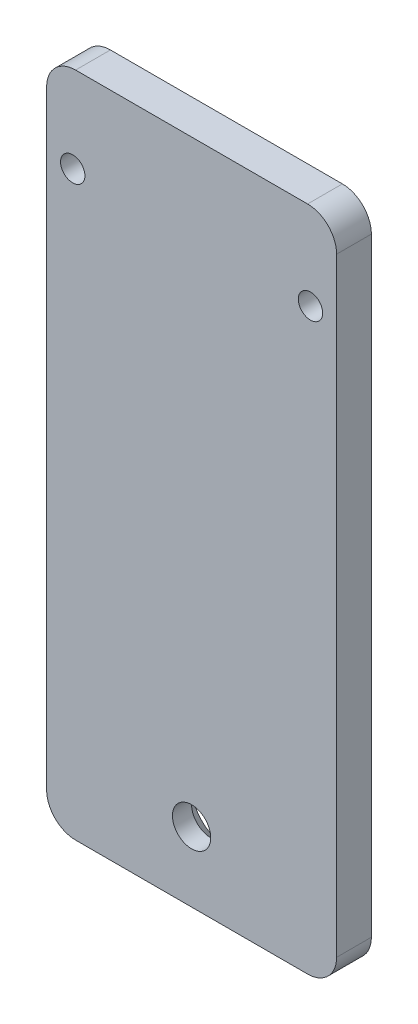
ISO-10303-21;
HEADER;
FILE_DESCRIPTION(('STEP AP214'),'2;1');
FILE_NAME('part.step','',(''),(''),'','','');
FILE_SCHEMA(('AUTOMOTIVE_DESIGN { 1 0 10303 214 1 1 1 1 }'));
ENDSEC;
DATA;
#1=APPLICATION_CONTEXT('core data for automotive mechanical design processes');
#2=APPLICATION_PROTOCOL_DEFINITION('international standard','automotive_design',2000,#1);
#3=PRODUCT_CONTEXT('',#1,'mechanical');
#4=PRODUCT('Part','Part','',(#3));
#5=PRODUCT_RELATED_PRODUCT_CATEGORY('part','',(#4));
#6=PRODUCT_DEFINITION_FORMATION('','',#4);
#7=PRODUCT_DEFINITION_CONTEXT('part definition',#1,'design');
#8=PRODUCT_DEFINITION('design','',#6,#7);
#9=PRODUCT_DEFINITION_SHAPE('','',#8);
#10=(LENGTH_UNIT() NAMED_UNIT(*) SI_UNIT(.MILLI.,.METRE.));
#11=(NAMED_UNIT(*) PLANE_ANGLE_UNIT() SI_UNIT($,.RADIAN.));
#12=(NAMED_UNIT(*) SI_UNIT($,.STERADIAN.) SOLID_ANGLE_UNIT());
#13=UNCERTAINTY_MEASURE_WITH_UNIT(LENGTH_MEASURE(1.E-05),#10,'distance_accuracy_value','');
#14=(GEOMETRIC_REPRESENTATION_CONTEXT(3) GLOBAL_UNCERTAINTY_ASSIGNED_CONTEXT((#13)) GLOBAL_UNIT_ASSIGNED_CONTEXT((#10,
#11,#12)) REPRESENTATION_CONTEXT('',''));
#15=CARTESIAN_POINT('',(0.,0.,0.));
#16=DIRECTION('',(0.,0.,1.));
#17=DIRECTION('',(1.,0.,0.));
#18=AXIS2_PLACEMENT_3D('',#15,#16,#17);
#19=CARTESIAN_POINT('',(0.,-45.5,-3.));
#20=DIRECTION('',(0.,0.,-1.));
#21=DIRECTION('',(0.,-1.,0.));
#22=AXIS2_PLACEMENT_3D('',#19,#20,#21);
#23=CONICAL_SURFACE('',#22,6.,0.785398163397448);
#24=CARTESIAN_POINT('',(0.,-45.5,-0.3));
#25=DIRECTION('',(0.,0.,-1.));
#26=DIRECTION('',(0.,-1.,0.));
#27=AXIS2_PLACEMENT_3D('',#24,#25,#26);
#28=CIRCLE('',#27,3.3);
#29=CARTESIAN_POINT('',(0.,-48.8,-0.3));
#30=VERTEX_POINT('',#29);
#31=EDGE_CURVE('E11',#30,#30,#28,.T.);
#32=ORIENTED_EDGE('',*,*,#31,.F.);
#33=EDGE_LOOP('',(#32));
#34=FACE_BOUND('',#33,.T.);
#35=CARTESIAN_POINT('',(0.,-45.5,-3.));
#36=DIRECTION('',(0.,0.,1.));
#37=DIRECTION('',(0.,-1.,0.));
#38=AXIS2_PLACEMENT_3D('',#35,#36,#37);
#39=CIRCLE('',#38,6.);
#40=CARTESIAN_POINT('',(0.,-51.5,-3.));
#41=VERTEX_POINT('',#40);
#42=EDGE_CURVE('E191',#41,#41,#39,.T.);
#43=ORIENTED_EDGE('',*,*,#42,.F.);
#44=EDGE_LOOP('',(#43));
#45=FACE_BOUND('',#44,.T.);
#46=ADVANCED_FACE('F17',(#34,#45),#23,.F.);
#47=CARTESIAN_POINT('',(0.,-45.5,125.242821379799));
#48=DIRECTION('',(0.,0.,-1.));
#49=DIRECTION('',(-1.,0.,0.));
#50=AXIS2_PLACEMENT_3D('',#47,#48,#49);
#51=CYLINDRICAL_SURFACE('',#50,3.3);
#52=CARTESIAN_POINT('',(0.,-45.5,3.));
#53=DIRECTION('',(0.,0.,1.));
#54=DIRECTION('',(1.,0.,0.));
#55=AXIS2_PLACEMENT_3D('',#52,#53,#54);
#56=CIRCLE('',#55,3.3);
#57=CARTESIAN_POINT('',(3.3,-45.5,3.));
#58=VERTEX_POINT('',#57);
#59=EDGE_CURVE('E108',#58,#58,#56,.T.);
#60=ORIENTED_EDGE('',*,*,#59,.T.);
#61=EDGE_LOOP('',(#60));
#62=FACE_BOUND('',#61,.T.);
#63=ORIENTED_EDGE('',*,*,#31,.T.);
#64=EDGE_LOOP('',(#63));
#65=FACE_BOUND('',#64,.T.);
#66=ADVANCED_FACE('F19',(#62,#65),#51,.F.);
#67=CARTESIAN_POINT('',(20.5,42.5,-122.542821379799));
#68=DIRECTION('',(0.,0.,1.));
#69=DIRECTION('',(1.,0.,0.));
#70=AXIS2_PLACEMENT_3D('',#67,#68,#69);
#71=CYLINDRICAL_SURFACE('',#70,2.1);
#72=CARTESIAN_POINT('',(20.5,42.5,3.));
#73=DIRECTION('',(0.,0.,1.));
#74=DIRECTION('',(1.,0.,0.));
#75=AXIS2_PLACEMENT_3D('',#72,#73,#74);
#76=CIRCLE('',#75,2.1);
#77=CARTESIAN_POINT('',(22.6,42.5,3.));
#78=VERTEX_POINT('',#77);
#79=EDGE_CURVE('E231',#78,#78,#76,.T.);
#80=ORIENTED_EDGE('',*,*,#79,.T.);
#81=EDGE_LOOP('',(#80));
#82=FACE_BOUND('',#81,.T.);
#83=CARTESIAN_POINT('',(20.5,42.5,-3.));
#84=DIRECTION('',(0.,0.,1.));
#85=DIRECTION('',(1.,0.,0.));
#86=AXIS2_PLACEMENT_3D('',#83,#84,#85);
#87=CIRCLE('',#86,2.1);
#88=CARTESIAN_POINT('',(22.6,42.5,-3.));
#89=VERTEX_POINT('',#88);
#90=EDGE_CURVE('E194',#89,#89,#87,.T.);
#91=ORIENTED_EDGE('',*,*,#90,.F.);
#92=EDGE_LOOP('',(#91));
#93=FACE_BOUND('',#92,.T.);
#94=ADVANCED_FACE('F289',(#82,#93),#71,.F.);
#95=CARTESIAN_POINT('',(-20.5,42.5,-122.542821379799));
#96=DIRECTION('',(0.,0.,1.));
#97=DIRECTION('',(1.,0.,0.));
#98=AXIS2_PLACEMENT_3D('',#95,#96,#97);
#99=CYLINDRICAL_SURFACE('',#98,2.1);
#100=CARTESIAN_POINT('',(-20.5,42.5,3.));
#101=DIRECTION('',(0.,0.,1.));
#102=DIRECTION('',(1.,0.,0.));
#103=AXIS2_PLACEMENT_3D('',#100,#101,#102);
#104=CIRCLE('',#103,2.1);
#105=CARTESIAN_POINT('',(-18.4,42.5,3.));
#106=VERTEX_POINT('',#105);
#107=EDGE_CURVE('E21',#106,#106,#104,.T.);
#108=ORIENTED_EDGE('',*,*,#107,.T.);
#109=EDGE_LOOP('',(#108));
#110=FACE_BOUND('',#109,.T.);
#111=CARTESIAN_POINT('',(-20.5,42.5,-3.));
#112=DIRECTION('',(0.,0.,1.));
#113=DIRECTION('',(1.,0.,0.));
#114=AXIS2_PLACEMENT_3D('',#111,#112,#113);
#115=CIRCLE('',#114,2.1);
#116=CARTESIAN_POINT('',(-18.4,42.5,-3.));
#117=VERTEX_POINT('',#116);
#118=EDGE_CURVE('E148',#117,#117,#115,.T.);
#119=ORIENTED_EDGE('',*,*,#118,.F.);
#120=EDGE_LOOP('',(#119));
#121=FACE_BOUND('',#120,.T.);
#122=ADVANCED_FACE('F279',(#110,#121),#99,.F.);
#123=CARTESIAN_POINT('',(-20.,52.5,3.));
#124=DIRECTION('',(0.,0.,-1.));
#125=DIRECTION('',(-1.,0.,0.));
#126=AXIS2_PLACEMENT_3D('',#123,#124,#125);
#127=CYLINDRICAL_SURFACE('',#126,5.);
#128=CARTESIAN_POINT('',(-20.,52.5,3.));
#129=DIRECTION('',(0.,0.,1.));
#130=DIRECTION('',(1.,0.,0.));
#131=AXIS2_PLACEMENT_3D('',#128,#129,#130);
#132=CIRCLE('',#131,5.);
#133=CARTESIAN_POINT('',(-20.,57.5,3.));
#134=VERTEX_POINT('',#133);
#135=CARTESIAN_POINT('',(-25.,52.5,3.));
#136=VERTEX_POINT('',#135);
#137=EDGE_CURVE('E188',#134,#136,#132,.T.);
#138=ORIENTED_EDGE('',*,*,#137,.F.);
#139=DIRECTION('',(0.,0.,1.));
#140=VECTOR('',#139,1.);
#141=CARTESIAN_POINT('',(-20.,57.5,3.));
#142=LINE('',#141,#140);
#143=CARTESIAN_POINT('',(-20.,57.5,-3.));
#144=VERTEX_POINT('',#143);
#145=EDGE_CURVE('E142',#144,#134,#142,.T.);
#146=ORIENTED_EDGE('',*,*,#145,.F.);
#147=CARTESIAN_POINT('',(-20.,52.5,-3.));
#148=DIRECTION('',(0.,0.,-1.));
#149=DIRECTION('',(1.,0.,0.));
#150=AXIS2_PLACEMENT_3D('',#147,#148,#149);
#151=CIRCLE('',#150,5.);
#152=CARTESIAN_POINT('',(-25.,52.5,-3.));
#153=VERTEX_POINT('',#152);
#154=EDGE_CURVE('E135',#153,#144,#151,.T.);
#155=ORIENTED_EDGE('',*,*,#154,.F.);
#156=DIRECTION('',(0.,0.,-1.));
#157=VECTOR('',#156,1.);
#158=CARTESIAN_POINT('',(-25.,52.5,3.));
#159=LINE('',#158,#157);
#160=EDGE_CURVE('E139',#136,#153,#159,.T.);
#161=ORIENTED_EDGE('',*,*,#160,.F.);
#162=EDGE_LOOP('',(#138,#146,#155,#161));
#163=FACE_BOUND('',#162,.T.);
#164=ADVANCED_FACE('F137',(#163),#127,.T.);
#165=CARTESIAN_POINT('',(20.,-52.5,3.));
#166=DIRECTION('',(0.,0.,-1.));
#167=DIRECTION('',(-1.,0.,0.));
#168=AXIS2_PLACEMENT_3D('',#165,#166,#167);
#169=CYLINDRICAL_SURFACE('',#168,5.);
#170=CARTESIAN_POINT('',(20.,-52.5,3.));
#171=DIRECTION('',(0.,0.,1.));
#172=DIRECTION('',(1.,0.,0.));
#173=AXIS2_PLACEMENT_3D('',#170,#171,#172);
#174=CIRCLE('',#173,5.);
#175=CARTESIAN_POINT('',(20.,-57.5,3.));
#176=VERTEX_POINT('',#175);
#177=CARTESIAN_POINT('',(25.,-52.5,3.));
#178=VERTEX_POINT('',#177);
#179=EDGE_CURVE('E172',#176,#178,#174,.T.);
#180=ORIENTED_EDGE('',*,*,#179,.F.);
#181=DIRECTION('',(0.,0.,1.));
#182=VECTOR('',#181,1.);
#183=CARTESIAN_POINT('',(20.,-57.5,3.));
#184=LINE('',#183,#182);
#185=CARTESIAN_POINT('',(20.,-57.5,-3.));
#186=VERTEX_POINT('',#185);
#187=EDGE_CURVE('E208',#186,#176,#184,.T.);
#188=ORIENTED_EDGE('',*,*,#187,.F.);
#189=CARTESIAN_POINT('',(20.,-52.5,-3.));
#190=DIRECTION('',(0.,0.,-1.));
#191=DIRECTION('',(1.,0.,0.));
#192=AXIS2_PLACEMENT_3D('',#189,#190,#191);
#193=CIRCLE('',#192,5.);
#194=CARTESIAN_POINT('',(25.,-52.5,-3.));
#195=VERTEX_POINT('',#194);
#196=EDGE_CURVE('E195',#195,#186,#193,.T.);
#197=ORIENTED_EDGE('',*,*,#196,.F.);
#198=DIRECTION('',(0.,0.,-1.));
#199=VECTOR('',#198,1.);
#200=CARTESIAN_POINT('',(25.,-52.5,3.));
#201=LINE('',#200,#199);
#202=EDGE_CURVE('E178',#178,#195,#201,.T.);
#203=ORIENTED_EDGE('',*,*,#202,.F.);
#204=EDGE_LOOP('',(#180,#188,#197,#203));
#205=FACE_BOUND('',#204,.T.);
#206=ADVANCED_FACE('F270',(#205),#169,.T.);
#207=CARTESIAN_POINT('',(-20.,-52.5,3.));
#208=DIRECTION('',(0.,0.,-1.));
#209=DIRECTION('',(-1.,0.,0.));
#210=AXIS2_PLACEMENT_3D('',#207,#208,#209);
#211=CYLINDRICAL_SURFACE('',#210,5.);
#212=CARTESIAN_POINT('',(-20.,-52.5,3.));
#213=DIRECTION('',(0.,0.,1.));
#214=DIRECTION('',(1.,0.,0.));
#215=AXIS2_PLACEMENT_3D('',#212,#213,#214);
#216=CIRCLE('',#215,5.);
#217=CARTESIAN_POINT('',(-25.,-52.5,3.));
#218=VERTEX_POINT('',#217);
#219=CARTESIAN_POINT('',(-20.,-57.5,3.));
#220=VERTEX_POINT('',#219);
#221=EDGE_CURVE('E173',#218,#220,#216,.T.);
#222=ORIENTED_EDGE('',*,*,#221,.F.);
#223=DIRECTION('',(0.,0.,1.));
#224=VECTOR('',#223,1.);
#225=CARTESIAN_POINT('',(-25.,-52.5,3.));
#226=LINE('',#225,#224);
#227=CARTESIAN_POINT('',(-25.,-52.5,-3.));
#228=VERTEX_POINT('',#227);
#229=EDGE_CURVE('E159',#228,#218,#226,.T.);
#230=ORIENTED_EDGE('',*,*,#229,.F.);
#231=CARTESIAN_POINT('',(-20.,-52.5,-3.));
#232=DIRECTION('',(0.,0.,-1.));
#233=DIRECTION('',(1.,0.,0.));
#234=AXIS2_PLACEMENT_3D('',#231,#232,#233);
#235=CIRCLE('',#234,5.);
#236=CARTESIAN_POINT('',(-20.,-57.5,-3.));
#237=VERTEX_POINT('',#236);
#238=EDGE_CURVE('E28',#237,#228,#235,.T.);
#239=ORIENTED_EDGE('',*,*,#238,.F.);
#240=DIRECTION('',(0.,0.,-1.));
#241=VECTOR('',#240,1.);
#242=CARTESIAN_POINT('',(-20.,-57.5,3.));
#243=LINE('',#242,#241);
#244=EDGE_CURVE('E179',#220,#237,#243,.T.);
#245=ORIENTED_EDGE('',*,*,#244,.F.);
#246=EDGE_LOOP('',(#222,#230,#239,#245));
#247=FACE_BOUND('',#246,.T.);
#248=ADVANCED_FACE('F242',(#247),#211,.T.);
#249=CARTESIAN_POINT('',(20.,52.5,3.));
#250=DIRECTION('',(0.,0.,-1.));
#251=DIRECTION('',(-1.,0.,0.));
#252=AXIS2_PLACEMENT_3D('',#249,#250,#251);
#253=CYLINDRICAL_SURFACE('',#252,5.);
#254=CARTESIAN_POINT('',(20.,52.5,3.));
#255=DIRECTION('',(0.,0.,1.));
#256=DIRECTION('',(1.,0.,0.));
#257=AXIS2_PLACEMENT_3D('',#254,#255,#256);
#258=CIRCLE('',#257,5.);
#259=CARTESIAN_POINT('',(25.,52.5,3.));
#260=VERTEX_POINT('',#259);
#261=CARTESIAN_POINT('',(20.,57.5,3.));
#262=VERTEX_POINT('',#261);
#263=EDGE_CURVE('E117',#260,#262,#258,.T.);
#264=ORIENTED_EDGE('',*,*,#263,.F.);
#265=DIRECTION('',(0.,0.,1.));
#266=VECTOR('',#265,1.);
#267=CARTESIAN_POINT('',(25.,52.5,3.));
#268=LINE('',#267,#266);
#269=CARTESIAN_POINT('',(25.,52.5,-3.));
#270=VERTEX_POINT('',#269);
#271=EDGE_CURVE('E227',#270,#260,#268,.T.);
#272=ORIENTED_EDGE('',*,*,#271,.F.);
#273=CARTESIAN_POINT('',(20.,52.5,-3.));
#274=DIRECTION('',(0.,0.,-1.));
#275=DIRECTION('',(1.,0.,0.));
#276=AXIS2_PLACEMENT_3D('',#273,#274,#275);
#277=CIRCLE('',#276,5.);
#278=CARTESIAN_POINT('',(20.,57.5,-3.));
#279=VERTEX_POINT('',#278);
#280=EDGE_CURVE('E147',#279,#270,#277,.T.);
#281=ORIENTED_EDGE('',*,*,#280,.F.);
#282=DIRECTION('',(0.,0.,-1.));
#283=VECTOR('',#282,1.);
#284=CARTESIAN_POINT('',(20.,57.5,3.));
#285=LINE('',#284,#283);
#286=EDGE_CURVE('E180',#262,#279,#285,.T.);
#287=ORIENTED_EDGE('',*,*,#286,.F.);
#288=EDGE_LOOP('',(#264,#272,#281,#287));
#289=FACE_BOUND('',#288,.T.);
#290=ADVANCED_FACE('F265',(#289),#253,.T.);
#291=CARTESIAN_POINT('',(0.,0.,-3.));
#292=DIRECTION('',(0.,0.,1.));
#293=DIRECTION('',(1.,0.,0.));
#294=AXIS2_PLACEMENT_3D('',#291,#292,#293);
#295=PLANE('',#294);
#296=DIRECTION('',(0.,-1.,0.));
#297=VECTOR('',#296,1.);
#298=CARTESIAN_POINT('',(-25.,57.5,-3.));
#299=LINE('',#298,#297);
#300=EDGE_CURVE('E151',#153,#228,#299,.T.);
#301=ORIENTED_EDGE('',*,*,#300,.F.);
#302=ORIENTED_EDGE('',*,*,#154,.T.);
#303=DIRECTION('',(-1.,0.,0.));
#304=VECTOR('',#303,1.);
#305=CARTESIAN_POINT('',(25.,57.5,-3.));
#306=LINE('',#305,#304);
#307=EDGE_CURVE('E187',#279,#144,#306,.T.);
#308=ORIENTED_EDGE('',*,*,#307,.F.);
#309=ORIENTED_EDGE('',*,*,#280,.T.);
#310=DIRECTION('',(0.,1.,0.));
#311=VECTOR('',#310,1.);
#312=CARTESIAN_POINT('',(25.,-57.5,-3.));
#313=LINE('',#312,#311);
#314=EDGE_CURVE('E214',#195,#270,#313,.T.);
#315=ORIENTED_EDGE('',*,*,#314,.F.);
#316=ORIENTED_EDGE('',*,*,#196,.T.);
#317=DIRECTION('',(1.,0.,0.));
#318=VECTOR('',#317,1.);
#319=CARTESIAN_POINT('',(-25.,-57.5,-3.));
#320=LINE('',#319,#318);
#321=EDGE_CURVE('E201',#237,#186,#320,.T.);
#322=ORIENTED_EDGE('',*,*,#321,.F.);
#323=ORIENTED_EDGE('',*,*,#238,.T.);
#324=EDGE_LOOP('',(#301,#302,#308,#309,#315,#316,#322,#323));
#325=FACE_BOUND('',#324,.T.);
#326=ORIENTED_EDGE('',*,*,#118,.T.);
#327=EDGE_LOOP('',(#326));
#328=FACE_BOUND('',#327,.T.);
#329=ORIENTED_EDGE('',*,*,#90,.T.);
#330=EDGE_LOOP('',(#329));
#331=FACE_BOUND('',#330,.T.);
#332=ORIENTED_EDGE('',*,*,#42,.T.);
#333=EDGE_LOOP('',(#332));
#334=FACE_BOUND('',#333,.T.);
#335=ADVANCED_FACE('F152',(#325,#328,#331,#334),#295,.F.);
#336=CARTESIAN_POINT('',(0.,0.,3.));
#337=DIRECTION('',(0.,0.,1.));
#338=DIRECTION('',(1.,0.,0.));
#339=AXIS2_PLACEMENT_3D('',#336,#337,#338);
#340=PLANE('',#339);
#341=DIRECTION('',(-1.,0.,0.));
#342=VECTOR('',#341,1.);
#343=CARTESIAN_POINT('',(25.,57.5,3.));
#344=LINE('',#343,#342);
#345=EDGE_CURVE('E184',#262,#134,#344,.T.);
#346=ORIENTED_EDGE('',*,*,#345,.T.);
#347=ORIENTED_EDGE('',*,*,#137,.T.);
#348=DIRECTION('',(0.,-1.,0.));
#349=VECTOR('',#348,1.);
#350=CARTESIAN_POINT('',(-25.,57.5,3.));
#351=LINE('',#350,#349);
#352=EDGE_CURVE('E163',#136,#218,#351,.T.);
#353=ORIENTED_EDGE('',*,*,#352,.T.);
#354=ORIENTED_EDGE('',*,*,#221,.T.);
#355=DIRECTION('',(1.,0.,0.));
#356=VECTOR('',#355,1.);
#357=CARTESIAN_POINT('',(-25.,-57.5,3.));
#358=LINE('',#357,#356);
#359=EDGE_CURVE('E217',#220,#176,#358,.T.);
#360=ORIENTED_EDGE('',*,*,#359,.T.);
#361=ORIENTED_EDGE('',*,*,#179,.T.);
#362=DIRECTION('',(0.,1.,0.));
#363=VECTOR('',#362,1.);
#364=CARTESIAN_POINT('',(25.,-57.5,3.));
#365=LINE('',#364,#363);
#366=EDGE_CURVE('E175',#178,#260,#365,.T.);
#367=ORIENTED_EDGE('',*,*,#366,.T.);
#368=ORIENTED_EDGE('',*,*,#263,.T.);
#369=EDGE_LOOP('',(#346,#347,#353,#354,#360,#361,#367,#368));
#370=FACE_BOUND('',#369,.T.);
#371=ORIENTED_EDGE('',*,*,#107,.F.);
#372=EDGE_LOOP('',(#371));
#373=FACE_BOUND('',#372,.T.);
#374=ORIENTED_EDGE('',*,*,#79,.F.);
#375=EDGE_LOOP('',(#374));
#376=FACE_BOUND('',#375,.T.);
#377=ORIENTED_EDGE('',*,*,#59,.F.);
#378=EDGE_LOOP('',(#377));
#379=FACE_BOUND('',#378,.T.);
#380=ADVANCED_FACE('F237',(#370,#373,#376,#379),#340,.T.);
#381=CARTESIAN_POINT('',(25.,57.5,3.));
#382=DIRECTION('',(0.,-1.,0.));
#383=DIRECTION('',(0.,0.,-1.));
#384=AXIS2_PLACEMENT_3D('',#381,#382,#383);
#385=PLANE('',#384);
#386=ORIENTED_EDGE('',*,*,#307,.T.);
#387=ORIENTED_EDGE('',*,*,#145,.T.);
#388=ORIENTED_EDGE('',*,*,#345,.F.);
#389=ORIENTED_EDGE('',*,*,#286,.T.);
#390=EDGE_LOOP('',(#386,#387,#388,#389));
#391=FACE_BOUND('',#390,.T.);
#392=ADVANCED_FACE('F260',(#391),#385,.F.);
#393=CARTESIAN_POINT('',(25.,-57.5,3.));
#394=DIRECTION('',(-1.,0.,0.));
#395=DIRECTION('',(0.,0.,1.));
#396=AXIS2_PLACEMENT_3D('',#393,#394,#395);
#397=PLANE('',#396);
#398=ORIENTED_EDGE('',*,*,#366,.F.);
#399=ORIENTED_EDGE('',*,*,#202,.T.);
#400=ORIENTED_EDGE('',*,*,#314,.T.);
#401=ORIENTED_EDGE('',*,*,#271,.T.);
#402=EDGE_LOOP('',(#398,#399,#400,#401));
#403=FACE_BOUND('',#402,.T.);
#404=ADVANCED_FACE('F268',(#403),#397,.F.);
#405=CARTESIAN_POINT('',(-25.,-57.5,3.));
#406=DIRECTION('',(0.,1.,0.));
#407=DIRECTION('',(1.,0.,0.));
#408=AXIS2_PLACEMENT_3D('',#405,#406,#407);
#409=PLANE('',#408);
#410=ORIENTED_EDGE('',*,*,#321,.T.);
#411=ORIENTED_EDGE('',*,*,#187,.T.);
#412=ORIENTED_EDGE('',*,*,#359,.F.);
#413=ORIENTED_EDGE('',*,*,#244,.T.);
#414=EDGE_LOOP('',(#410,#411,#412,#413));
#415=FACE_BOUND('',#414,.T.);
#416=ADVANCED_FACE('F244',(#415),#409,.F.);
#417=CARTESIAN_POINT('',(-25.,57.5,3.));
#418=DIRECTION('',(1.,0.,0.));
#419=DIRECTION('',(0.,1.,0.));
#420=AXIS2_PLACEMENT_3D('',#417,#418,#419);
#421=PLANE('',#420);
#422=ORIENTED_EDGE('',*,*,#352,.F.);
#423=ORIENTED_EDGE('',*,*,#160,.T.);
#424=ORIENTED_EDGE('',*,*,#300,.T.);
#425=ORIENTED_EDGE('',*,*,#229,.T.);
#426=EDGE_LOOP('',(#422,#423,#424,#425));
#427=FACE_BOUND('',#426,.T.);
#428=ADVANCED_FACE('F161',(#427),#421,.F.);
#429=CLOSED_SHELL('',(#46,#66,#94,#122,#164,#206,#248,#290,#335,#380,#392,#404,#416,#428));
#430=MANIFOLD_SOLID_BREP('B1',#429);
#431=ADVANCED_BREP_SHAPE_REPRESENTATION('',(#18,#430),#14);
#432=SHAPE_DEFINITION_REPRESENTATION(#9,#431);
ENDSEC;
END-ISO-10303-21;
